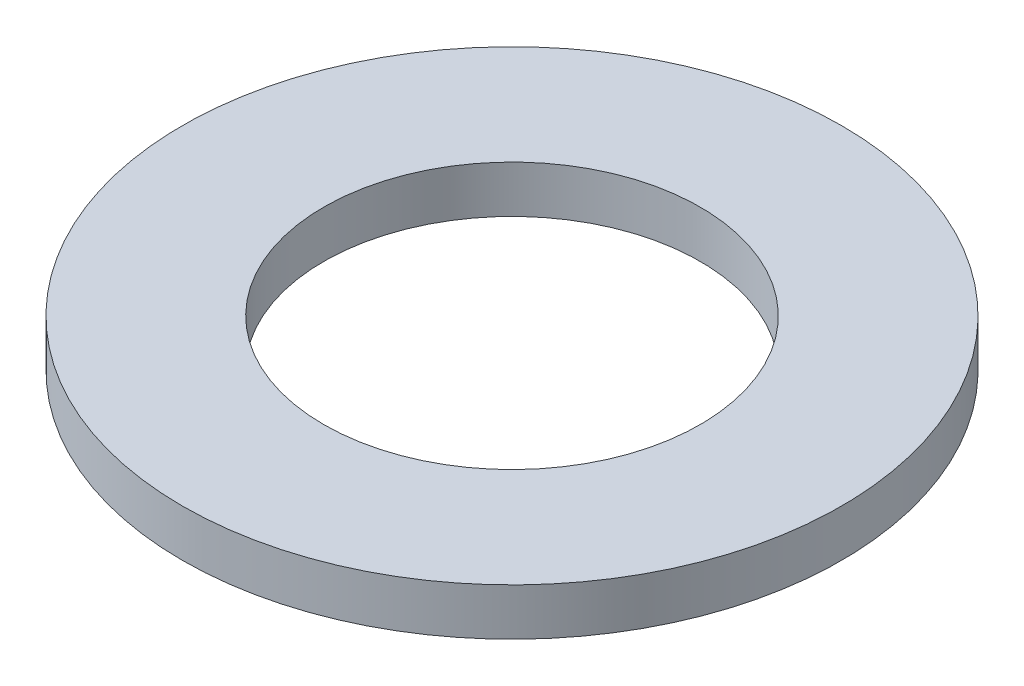
ISO-10303-21;
HEADER;
FILE_DESCRIPTION(('STEP AP214'),'2;1');
FILE_NAME('part.step','',(''),(''),'','','');
FILE_SCHEMA(('AUTOMOTIVE_DESIGN { 1 0 10303 214 1 1 1 1 }'));
ENDSEC;
DATA;
#1=APPLICATION_CONTEXT('core data for automotive mechanical design processes');
#2=APPLICATION_PROTOCOL_DEFINITION('international standard','automotive_design',2000,#1);
#3=PRODUCT_CONTEXT('',#1,'mechanical');
#4=PRODUCT('Part','Part','',(#3));
#5=PRODUCT_RELATED_PRODUCT_CATEGORY('part','',(#4));
#6=PRODUCT_DEFINITION_FORMATION('','',#4);
#7=PRODUCT_DEFINITION_CONTEXT('part definition',#1,'design');
#8=PRODUCT_DEFINITION('design','',#6,#7);
#9=PRODUCT_DEFINITION_SHAPE('','',#8);
#10=(LENGTH_UNIT() NAMED_UNIT(*) SI_UNIT(.MILLI.,.METRE.));
#11=(NAMED_UNIT(*) PLANE_ANGLE_UNIT() SI_UNIT($,.RADIAN.));
#12=(NAMED_UNIT(*) SI_UNIT($,.STERADIAN.) SOLID_ANGLE_UNIT());
#13=UNCERTAINTY_MEASURE_WITH_UNIT(LENGTH_MEASURE(1.E-05),#10,'distance_accuracy_value','');
#14=(GEOMETRIC_REPRESENTATION_CONTEXT(3) GLOBAL_UNCERTAINTY_ASSIGNED_CONTEXT((#13)) GLOBAL_UNIT_ASSIGNED_CONTEXT((#10,
#11,#12)) REPRESENTATION_CONTEXT('',''));
#15=CARTESIAN_POINT('',(0.,0.,0.));
#16=DIRECTION('',(0.,0.,1.));
#17=DIRECTION('',(1.,0.,0.));
#18=AXIS2_PLACEMENT_3D('',#15,#16,#17);
#19=CARTESIAN_POINT('',(0.,3.175,0.));
#20=DIRECTION('',(0.,1.,0.));
#21=DIRECTION('',(0.,0.,1.));
#22=AXIS2_PLACEMENT_3D('',#19,#20,#21);
#23=PLANE('',#22);
#24=CARTESIAN_POINT('',(0.,3.175,0.));
#25=DIRECTION('',(0.,1.,0.));
#26=DIRECTION('',(0.,0.,1.));
#27=AXIS2_PLACEMENT_3D('',#24,#25,#26);
#28=CIRCLE('',#27,22.225);
#29=CARTESIAN_POINT('',(0.,3.175,22.225));
#30=VERTEX_POINT('',#29);
#31=EDGE_CURVE('E10',#30,#30,#28,.T.);
#32=ORIENTED_EDGE('',*,*,#31,.T.);
#33=EDGE_LOOP('',(#32));
#34=FACE_BOUND('',#33,.T.);
#35=CARTESIAN_POINT('',(0.,3.175,0.));
#36=DIRECTION('',(0.,1.,0.));
#37=DIRECTION('',(0.,0.,1.));
#38=AXIS2_PLACEMENT_3D('',#35,#36,#37);
#39=CIRCLE('',#38,12.7);
#40=CARTESIAN_POINT('',(0.,3.175,12.7));
#41=VERTEX_POINT('',#40);
#42=EDGE_CURVE('E44',#41,#41,#39,.T.);
#43=ORIENTED_EDGE('',*,*,#42,.F.);
#44=EDGE_LOOP('',(#43));
#45=FACE_BOUND('',#44,.T.);
#46=ADVANCED_FACE('F33',(#34,#45),#23,.T.);
#47=CARTESIAN_POINT('',(0.,0.,0.));
#48=DIRECTION('',(0.,1.,0.));
#49=DIRECTION('',(0.,0.,1.));
#50=AXIS2_PLACEMENT_3D('',#47,#48,#49);
#51=PLANE('',#50);
#52=CARTESIAN_POINT('',(0.,0.,0.));
#53=DIRECTION('',(0.,1.,0.));
#54=DIRECTION('',(0.,0.,1.));
#55=AXIS2_PLACEMENT_3D('',#52,#53,#54);
#56=CIRCLE('',#55,22.225);
#57=CARTESIAN_POINT('',(0.,0.,22.225));
#58=VERTEX_POINT('',#57);
#59=EDGE_CURVE('E37',#58,#58,#56,.T.);
#60=ORIENTED_EDGE('',*,*,#59,.F.);
#61=EDGE_LOOP('',(#60));
#62=FACE_BOUND('',#61,.T.);
#63=CARTESIAN_POINT('',(0.,0.,0.));
#64=DIRECTION('',(0.,1.,0.));
#65=DIRECTION('',(0.,0.,1.));
#66=AXIS2_PLACEMENT_3D('',#63,#64,#65);
#67=CIRCLE('',#66,12.7);
#68=CARTESIAN_POINT('',(0.,0.,12.7));
#69=VERTEX_POINT('',#68);
#70=EDGE_CURVE('E46',#69,#69,#67,.T.);
#71=ORIENTED_EDGE('',*,*,#70,.T.);
#72=EDGE_LOOP('',(#71));
#73=FACE_BOUND('',#72,.T.);
#74=ADVANCED_FACE('F56',(#62,#73),#51,.F.);
#75=CARTESIAN_POINT('',(0.,3.175,0.));
#76=DIRECTION('',(0.,-1.,0.));
#77=DIRECTION('',(0.,0.,-1.));
#78=AXIS2_PLACEMENT_3D('',#75,#76,#77);
#79=CYLINDRICAL_SURFACE('',#78,22.225);
#80=ORIENTED_EDGE('',*,*,#31,.F.);
#81=EDGE_LOOP('',(#80));
#82=FACE_BOUND('',#81,.T.);
#83=ORIENTED_EDGE('',*,*,#59,.T.);
#84=EDGE_LOOP('',(#83));
#85=FACE_BOUND('',#84,.T.);
#86=ADVANCED_FACE('F35',(#82,#85),#79,.T.);
#87=CARTESIAN_POINT('',(0.,3.175,0.));
#88=DIRECTION('',(0.,-1.,0.));
#89=DIRECTION('',(0.,0.,-1.));
#90=AXIS2_PLACEMENT_3D('',#87,#88,#89);
#91=CYLINDRICAL_SURFACE('',#90,12.7);
#92=ORIENTED_EDGE('',*,*,#42,.T.);
#93=EDGE_LOOP('',(#92));
#94=FACE_BOUND('',#93,.T.);
#95=ORIENTED_EDGE('',*,*,#70,.F.);
#96=EDGE_LOOP('',(#95));
#97=FACE_BOUND('',#96,.T.);
#98=ADVANCED_FACE('F52',(#94,#97),#91,.F.);
#99=CLOSED_SHELL('',(#46,#74,#86,#98));
#100=MANIFOLD_SOLID_BREP('B2',#99);
#101=ADVANCED_BREP_SHAPE_REPRESENTATION('',(#18,#100),#14);
#102=SHAPE_DEFINITION_REPRESENTATION(#9,#101);
ENDSEC;
END-ISO-10303-21;
